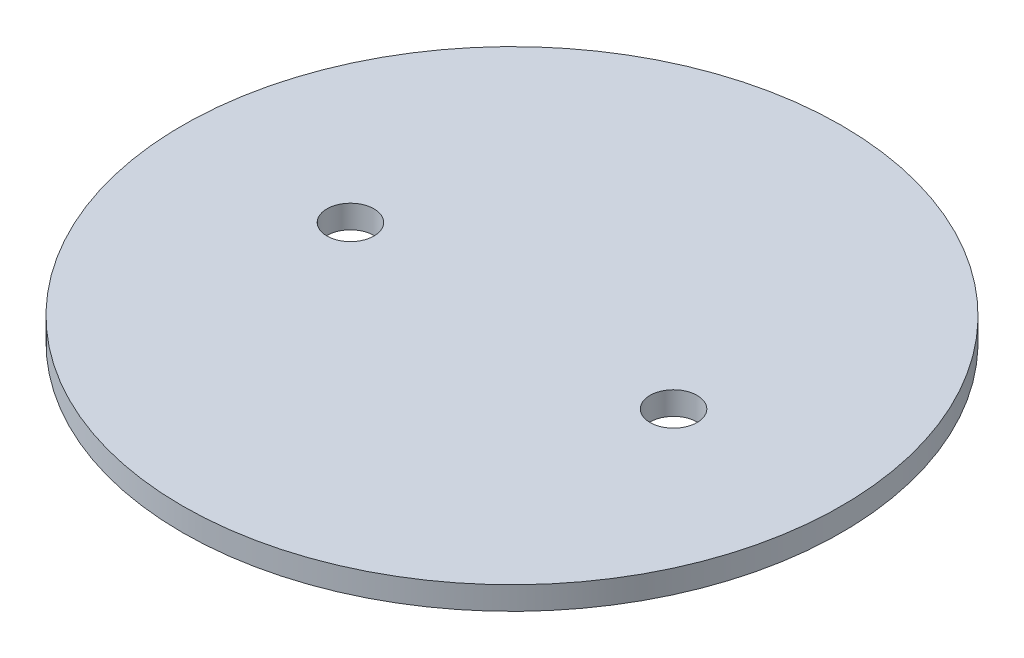
ISO-10303-21;
HEADER;
FILE_DESCRIPTION(('STEP AP214'),'2;1');
FILE_NAME('part.step','',(''),(''),'','','');
FILE_SCHEMA(('AUTOMOTIVE_DESIGN { 1 0 10303 214 1 1 1 1 }'));
ENDSEC;
DATA;
#1=APPLICATION_CONTEXT('core data for automotive mechanical design processes');
#2=APPLICATION_PROTOCOL_DEFINITION('international standard','automotive_design',2000,#1);
#3=PRODUCT_CONTEXT('',#1,'mechanical');
#4=PRODUCT('Part','Part','',(#3));
#5=PRODUCT_RELATED_PRODUCT_CATEGORY('part','',(#4));
#6=PRODUCT_DEFINITION_FORMATION('','',#4);
#7=PRODUCT_DEFINITION_CONTEXT('part definition',#1,'design');
#8=PRODUCT_DEFINITION('design','',#6,#7);
#9=PRODUCT_DEFINITION_SHAPE('','',#8);
#10=(LENGTH_UNIT() NAMED_UNIT(*) SI_UNIT(.MILLI.,.METRE.));
#11=(NAMED_UNIT(*) PLANE_ANGLE_UNIT() SI_UNIT($,.RADIAN.));
#12=(NAMED_UNIT(*) SI_UNIT($,.STERADIAN.) SOLID_ANGLE_UNIT());
#13=UNCERTAINTY_MEASURE_WITH_UNIT(LENGTH_MEASURE(1.E-05),#10,'distance_accuracy_value','');
#14=(GEOMETRIC_REPRESENTATION_CONTEXT(3) GLOBAL_UNCERTAINTY_ASSIGNED_CONTEXT((#13)) GLOBAL_UNIT_ASSIGNED_CONTEXT((#10,
#11,#12)) REPRESENTATION_CONTEXT('',''));
#15=CARTESIAN_POINT('',(0.,0.,0.));
#16=DIRECTION('',(0.,0.,1.));
#17=DIRECTION('',(1.,0.,0.));
#18=AXIS2_PLACEMENT_3D('',#15,#16,#17);
#19=CARTESIAN_POINT('',(0.,3.175,0.));
#20=DIRECTION('',(0.,1.,0.));
#21=DIRECTION('',(0.,0.,1.));
#22=AXIS2_PLACEMENT_3D('',#19,#20,#21);
#23=PLANE('',#22);
#24=CARTESIAN_POINT('',(22.225,3.175,0.));
#25=DIRECTION('',(0.,1.,0.));
#26=DIRECTION('',(0.,0.,1.));
#27=AXIS2_PLACEMENT_3D('',#24,#25,#26);
#28=CIRCLE('',#27,3.2385);
#29=CARTESIAN_POINT('',(22.225,3.175,3.2385));
#30=VERTEX_POINT('',#29);
#31=EDGE_CURVE('E52',#30,#30,#28,.T.);
#32=ORIENTED_EDGE('',*,*,#31,.F.);
#33=EDGE_LOOP('',(#32));
#34=FACE_BOUND('',#33,.T.);
#35=CARTESIAN_POINT('',(0.,3.175,0.));
#36=DIRECTION('',(0.,1.,0.));
#37=DIRECTION('',(0.,0.,1.));
#38=AXIS2_PLACEMENT_3D('',#35,#36,#37);
#39=CIRCLE('',#38,45.339);
#40=CARTESIAN_POINT('',(0.,3.175,45.339));
#41=VERTEX_POINT('',#40);
#42=EDGE_CURVE('E10',#41,#41,#39,.T.);
#43=ORIENTED_EDGE('',*,*,#42,.T.);
#44=EDGE_LOOP('',(#43));
#45=FACE_BOUND('',#44,.T.);
#46=CARTESIAN_POINT('',(-22.225,3.175,0.));
#47=DIRECTION('',(0.,1.,0.));
#48=DIRECTION('',(0.,0.,1.));
#49=AXIS2_PLACEMENT_3D('',#46,#47,#48);
#50=CIRCLE('',#49,3.2385);
#51=CARTESIAN_POINT('',(-22.225,3.175,3.2385));
#52=VERTEX_POINT('',#51);
#53=EDGE_CURVE('E57',#52,#52,#50,.T.);
#54=ORIENTED_EDGE('',*,*,#53,.F.);
#55=EDGE_LOOP('',(#54));
#56=FACE_BOUND('',#55,.T.);
#57=ADVANCED_FACE('F41',(#34,#45,#56),#23,.T.);
#58=CARTESIAN_POINT('',(0.,0.,0.));
#59=DIRECTION('',(0.,1.,0.));
#60=DIRECTION('',(0.,0.,1.));
#61=AXIS2_PLACEMENT_3D('',#58,#59,#60);
#62=PLANE('',#61);
#63=CARTESIAN_POINT('',(0.,0.,0.));
#64=DIRECTION('',(0.,1.,0.));
#65=DIRECTION('',(0.,0.,1.));
#66=AXIS2_PLACEMENT_3D('',#63,#64,#65);
#67=CIRCLE('',#66,45.339);
#68=CARTESIAN_POINT('',(0.,0.,45.339));
#69=VERTEX_POINT('',#68);
#70=EDGE_CURVE('E45',#69,#69,#67,.T.);
#71=ORIENTED_EDGE('',*,*,#70,.F.);
#72=EDGE_LOOP('',(#71));
#73=FACE_BOUND('',#72,.T.);
#74=CARTESIAN_POINT('',(22.225,0.,0.));
#75=DIRECTION('',(0.,1.,0.));
#76=DIRECTION('',(0.,0.,1.));
#77=AXIS2_PLACEMENT_3D('',#74,#75,#76);
#78=CIRCLE('',#77,3.2385);
#79=CARTESIAN_POINT('',(22.225,0.,3.2385));
#80=VERTEX_POINT('',#79);
#81=EDGE_CURVE('E54',#80,#80,#78,.T.);
#82=ORIENTED_EDGE('',*,*,#81,.T.);
#83=EDGE_LOOP('',(#82));
#84=FACE_BOUND('',#83,.T.);
#85=CARTESIAN_POINT('',(-22.225,0.,0.));
#86=DIRECTION('',(0.,1.,0.));
#87=DIRECTION('',(0.,0.,1.));
#88=AXIS2_PLACEMENT_3D('',#85,#86,#87);
#89=CIRCLE('',#88,3.2385);
#90=CARTESIAN_POINT('',(-22.225,0.,3.2385));
#91=VERTEX_POINT('',#90);
#92=EDGE_CURVE('E60',#91,#91,#89,.T.);
#93=ORIENTED_EDGE('',*,*,#92,.T.);
#94=EDGE_LOOP('',(#93));
#95=FACE_BOUND('',#94,.T.);
#96=ADVANCED_FACE('F70',(#73,#84,#95),#62,.F.);
#97=CARTESIAN_POINT('',(0.,3.175,0.));
#98=DIRECTION('',(0.,-1.,0.));
#99=DIRECTION('',(0.,0.,-1.));
#100=AXIS2_PLACEMENT_3D('',#97,#98,#99);
#101=CYLINDRICAL_SURFACE('',#100,45.339);
#102=ORIENTED_EDGE('',*,*,#42,.F.);
#103=EDGE_LOOP('',(#102));
#104=FACE_BOUND('',#103,.T.);
#105=ORIENTED_EDGE('',*,*,#70,.T.);
#106=EDGE_LOOP('',(#105));
#107=FACE_BOUND('',#106,.T.);
#108=ADVANCED_FACE('F43',(#104,#107),#101,.T.);
#109=CARTESIAN_POINT('',(22.225,3.175,0.));
#110=DIRECTION('',(0.,-1.,0.));
#111=DIRECTION('',(0.,0.,-1.));
#112=AXIS2_PLACEMENT_3D('',#109,#110,#111);
#113=CYLINDRICAL_SURFACE('',#112,3.2385);
#114=ORIENTED_EDGE('',*,*,#31,.T.);
#115=EDGE_LOOP('',(#114));
#116=FACE_BOUND('',#115,.T.);
#117=ORIENTED_EDGE('',*,*,#81,.F.);
#118=EDGE_LOOP('',(#117));
#119=FACE_BOUND('',#118,.T.);
#120=ADVANCED_FACE('F79',(#116,#119),#113,.F.);
#121=CARTESIAN_POINT('',(-22.225,3.175,0.));
#122=DIRECTION('',(0.,-1.,0.));
#123=DIRECTION('',(0.,0.,-1.));
#124=AXIS2_PLACEMENT_3D('',#121,#122,#123);
#125=CYLINDRICAL_SURFACE('',#124,3.2385);
#126=ORIENTED_EDGE('',*,*,#53,.T.);
#127=EDGE_LOOP('',(#126));
#128=FACE_BOUND('',#127,.T.);
#129=ORIENTED_EDGE('',*,*,#92,.F.);
#130=EDGE_LOOP('',(#129));
#131=FACE_BOUND('',#130,.T.);
#132=ADVANCED_FACE('F66',(#128,#131),#125,.F.);
#133=CLOSED_SHELL('',(#57,#96,#108,#120,#132));
#134=MANIFOLD_SOLID_BREP('B2',#133);
#135=ADVANCED_BREP_SHAPE_REPRESENTATION('',(#18,#134),#14);
#136=SHAPE_DEFINITION_REPRESENTATION(#9,#135);
ENDSEC;
END-ISO-10303-21;
